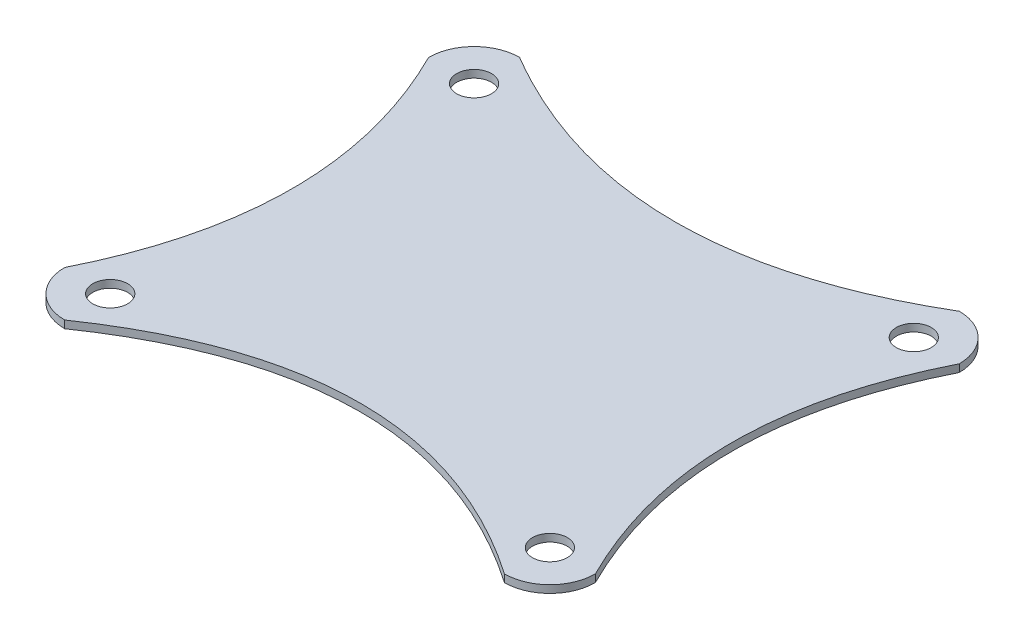
ISO-10303-21;
HEADER;
FILE_DESCRIPTION(('STEP AP214'),'2;1');
FILE_NAME('part.step','',(''),(''),'','','');
FILE_SCHEMA(('AUTOMOTIVE_DESIGN { 1 0 10303 214 1 1 1 1 }'));
ENDSEC;
DATA;
#1=APPLICATION_CONTEXT('core data for automotive mechanical design processes');
#2=APPLICATION_PROTOCOL_DEFINITION('international standard','automotive_design',2000,#1);
#3=PRODUCT_CONTEXT('',#1,'mechanical');
#4=PRODUCT('Part','Part','',(#3));
#5=PRODUCT_RELATED_PRODUCT_CATEGORY('part','',(#4));
#6=PRODUCT_DEFINITION_FORMATION('','',#4);
#7=PRODUCT_DEFINITION_CONTEXT('part definition',#1,'design');
#8=PRODUCT_DEFINITION('design','',#6,#7);
#9=PRODUCT_DEFINITION_SHAPE('','',#8);
#10=(LENGTH_UNIT() NAMED_UNIT(*) SI_UNIT(.MILLI.,.METRE.));
#11=(NAMED_UNIT(*) PLANE_ANGLE_UNIT() SI_UNIT($,.RADIAN.));
#12=(NAMED_UNIT(*) SI_UNIT($,.STERADIAN.) SOLID_ANGLE_UNIT());
#13=UNCERTAINTY_MEASURE_WITH_UNIT(LENGTH_MEASURE(1.E-05),#10,'distance_accuracy_value','');
#14=(GEOMETRIC_REPRESENTATION_CONTEXT(3) GLOBAL_UNCERTAINTY_ASSIGNED_CONTEXT((#13)) GLOBAL_UNIT_ASSIGNED_CONTEXT((#10,
#11,#12)) REPRESENTATION_CONTEXT('',''));
#15=CARTESIAN_POINT('',(0.,0.,0.));
#16=DIRECTION('',(0.,0.,1.));
#17=DIRECTION('',(1.,0.,0.));
#18=AXIS2_PLACEMENT_3D('',#15,#16,#17);
#19=CARTESIAN_POINT('',(-59.7824977169571,-7.66920387963483,37.1259500647923));
#20=CARTESIAN_POINT('',(-45.2824977169571,-7.66920387962384,27.1259500647924));
#21=CARTESIAN_POINT('',(-30.7824977169571,-7.66920387961284,37.1259500647923));
#22=B_SPLINE_CURVE_WITH_KNOTS('',2,(#19,#20,#21),.UNSPECIFIED.,.F.,.F.,(3,3),(0.,1.),.UNSPECIFIED.);
#23=DIRECTION('',(7.58386409227541E-13,-1.,0.));
#24=VECTOR('',#23,1.);
#25=SURFACE_OF_LINEAR_EXTRUSION('',#22,#24);
#26=CARTESIAN_POINT('',(6439.3146370314,-8.16920387461947,1000032.12595006));
#27=CARTESIAN_POINT('',(-45.2824977156333,-8.16920387971058,-999967.874049935));
#28=CARTESIAN_POINT('',(-6529.87963246795,-8.16920388445474,1000032.12595006));
#29=B_SPLINE_CURVE_WITH_KNOTS('',2,(#26,#27,#28),.UNSPECIFIED.,.F.,.F.,(3,3),(0.,1.),.UNSPECIFIED.);
#30=CARTESIAN_POINT('',(-30.7824977169568,-8.16920387961284,37.1259500647923));
#31=VERTEX_POINT('',#30);
#32=CARTESIAN_POINT('',(-59.7824977169567,-8.16920387963484,37.1259500647923));
#33=VERTEX_POINT('',#32);
#34=EDGE_CURVE('E58',#31,#33,#29,.T.);
#35=ORIENTED_EDGE('',*,*,#34,.F.);
#36=DIRECTION('',(7.58386409227541E-13,-1.,0.));
#37=VECTOR('',#36,1.);
#38=CARTESIAN_POINT('',(-30.7824977169571,-7.66920387961284,37.1259500647923));
#39=LINE('',#38,#37);
#40=CARTESIAN_POINT('',(-30.7824977169571,-7.66920387961284,37.1259500647923));
#41=VERTEX_POINT('',#40);
#42=EDGE_CURVE('E127',#41,#31,#39,.T.);
#43=ORIENTED_EDGE('',*,*,#42,.F.);
#44=CARTESIAN_POINT('',(-59.7824977169571,-7.66920387963483,37.1259500647923));
#45=VERTEX_POINT('',#44);
#46=EDGE_CURVE('E231',#45,#41,#22,.T.);
#47=ORIENTED_EDGE('',*,*,#46,.F.);
#48=DIRECTION('',(7.58386409227541E-13,-1.,0.));
#49=VECTOR('',#48,1.);
#50=CARTESIAN_POINT('',(-59.7824977169571,-7.66920387963483,37.1259500647923));
#51=LINE('',#50,#49);
#52=EDGE_CURVE('E506',#45,#33,#51,.T.);
#53=ORIENTED_EDGE('',*,*,#52,.T.);
#54=EDGE_LOOP('',(#35,#43,#47,#53));
#55=FACE_BOUND('',#54,.T.);
#56=ADVANCED_FACE('F42',(#55),#25,.F.);
#57=CARTESIAN_POINT('',(-30.7824977169571,-7.66920387961284,34.1259500647923));
#58=DIRECTION('',(7.58386409227541E-13,-1.,0.));
#59=DIRECTION('',(1.,7.58386409227541E-13,0.));
#60=AXIS2_PLACEMENT_3D('',#57,#58,#59);
#61=CYLINDRICAL_SURFACE('',#60,3.00000000000001);
#62=CARTESIAN_POINT('',(-30.7824977169567,-8.16920387961284,34.1259500647923));
#63=DIRECTION('',(7.58356500202093E-13,-1.,0.));
#64=DIRECTION('',(1.,7.58356500202093E-13,0.));
#65=AXIS2_PLACEMENT_3D('',#62,#63,#64);
#66=CIRCLE('',#65,3.00000000000001);
#67=CARTESIAN_POINT('',(-27.7824977169567,-8.16920387961057,34.1259500647923));
#68=VERTEX_POINT('',#67);
#69=EDGE_CURVE('E110',#68,#31,#66,.T.);
#70=ORIENTED_EDGE('',*,*,#69,.F.);
#71=DIRECTION('',(7.58386409227541E-13,-1.,0.));
#72=VECTOR('',#71,1.);
#73=CARTESIAN_POINT('',(-27.7824977169571,-7.66920387961057,34.1259500647923));
#74=LINE('',#73,#72);
#75=CARTESIAN_POINT('',(-27.7824977169571,-7.66920387961057,34.1259500647923));
#76=VERTEX_POINT('',#75);
#77=EDGE_CURVE('E124',#76,#68,#74,.T.);
#78=ORIENTED_EDGE('',*,*,#77,.F.);
#79=CARTESIAN_POINT('',(-30.7824977169571,-7.66920387961284,34.1259500647923));
#80=DIRECTION('',(-7.58386409227541E-13,1.,0.));
#81=DIRECTION('',(-1.,-7.58386409227541E-13,0.));
#82=AXIS2_PLACEMENT_3D('',#79,#80,#81);
#83=CIRCLE('',#82,3.00000000000001);
#84=EDGE_CURVE('E238',#41,#76,#83,.T.);
#85=ORIENTED_EDGE('',*,*,#84,.F.);
#86=ORIENTED_EDGE('',*,*,#42,.T.);
#87=EDGE_LOOP('',(#70,#78,#85,#86));
#88=FACE_BOUND('',#87,.T.);
#89=ADVANCED_FACE('F123',(#88),#61,.T.);
#90=CARTESIAN_POINT('',(-27.7824977169571,-7.66920387961057,34.1259500647923));
#91=CARTESIAN_POINT('',(-33.7824977169571,-7.66920387961512,22.1259500647924));
#92=CARTESIAN_POINT('',(-27.7824977169571,-7.66920387961057,10.1259500647924));
#93=B_SPLINE_CURVE_WITH_KNOTS('',2,(#90,#91,#92),.UNSPECIFIED.,.F.,.F.,(3,3),(0.,1.),.UNSPECIFIED.);
#94=DIRECTION('',(7.58386409227541E-13,-1.,0.));
#95=VECTOR('',#94,1.);
#96=SURFACE_OF_LINEAR_EXTRUSION('',#93,#95);
#97=CARTESIAN_POINT('',(999969.217502283,-8.16920312125695,-6906.07728023078));
#98=CARTESIAN_POINT('',(-1000030.78249772,-8.16920463796935,22.1259500653703));
#99=CARTESIAN_POINT('',(999969.217502283,-8.16920312125574,6950.32918035921));
#100=B_SPLINE_CURVE_WITH_KNOTS('',2,(#97,#98,#99),.UNSPECIFIED.,.F.,.F.,(3,3),(0.,1.),.UNSPECIFIED.);
#101=CARTESIAN_POINT('',(-27.7824977353126,-8.16920387961057,10.1259500647924));
#102=VERTEX_POINT('',#101);
#103=EDGE_CURVE('E107',#102,#68,#100,.T.);
#104=ORIENTED_EDGE('',*,*,#103,.F.);
#105=DIRECTION('',(7.58386409227541E-13,-1.,0.));
#106=VECTOR('',#105,1.);
#107=CARTESIAN_POINT('',(-27.7824977169571,-7.66920387961057,10.1259500647924));
#108=LINE('',#107,#106);
#109=CARTESIAN_POINT('',(-27.7824977169571,-7.66920387961057,10.1259500647924));
#110=VERTEX_POINT('',#109);
#111=EDGE_CURVE('E133',#110,#102,#108,.T.);
#112=ORIENTED_EDGE('',*,*,#111,.F.);
#113=EDGE_CURVE('E131',#76,#110,#93,.T.);
#114=ORIENTED_EDGE('',*,*,#113,.F.);
#115=ORIENTED_EDGE('',*,*,#77,.T.);
#116=EDGE_LOOP('',(#104,#112,#114,#115));
#117=FACE_BOUND('',#116,.T.);
#118=ADVANCED_FACE('F130',(#117),#96,.F.);
#119=CARTESIAN_POINT('',(-30.7824977169571,-7.66920387961284,10.1259500647924));
#120=DIRECTION('',(7.58386409227541E-13,-1.,0.));
#121=DIRECTION('',(1.,7.58386409227541E-13,0.));
#122=AXIS2_PLACEMENT_3D('',#119,#120,#121);
#123=CYLINDRICAL_SURFACE('',#122,3.);
#124=CARTESIAN_POINT('',(-30.7824977169567,-8.16920387961285,10.1259500647924));
#125=DIRECTION('',(7.58356500202093E-13,-1.,0.));
#126=DIRECTION('',(1.,7.58356500202093E-13,0.));
#127=AXIS2_PLACEMENT_3D('',#124,#125,#126);
#128=CIRCLE('',#127,2.99999998164409);
#129=CARTESIAN_POINT('',(-30.7824977857175,-8.16920387961285,7.12595010526518));
#130=VERTEX_POINT('',#129);
#131=EDGE_CURVE('E112',#130,#102,#128,.T.);
#132=ORIENTED_EDGE('',*,*,#131,.F.);
#133=DIRECTION('',(7.58386409227541E-13,-1.,0.));
#134=VECTOR('',#133,1.);
#135=CARTESIAN_POINT('',(-30.7824977169571,-7.66920387961284,7.12595006479236));
#136=LINE('',#135,#134);
#137=CARTESIAN_POINT('',(-30.7824977169571,-7.66920387961284,7.12595006479236));
#138=VERTEX_POINT('',#137);
#139=EDGE_CURVE('E141',#138,#130,#136,.T.);
#140=ORIENTED_EDGE('',*,*,#139,.F.);
#141=CARTESIAN_POINT('',(-30.7824977169571,-7.66920387961284,10.1259500647924));
#142=DIRECTION('',(-7.58386409227541E-13,1.,0.));
#143=DIRECTION('',(-1.,-7.58386409227541E-13,0.));
#144=AXIS2_PLACEMENT_3D('',#141,#142,#143);
#145=CIRCLE('',#144,3.);
#146=EDGE_CURVE('E250',#110,#138,#145,.T.);
#147=ORIENTED_EDGE('',*,*,#146,.F.);
#148=ORIENTED_EDGE('',*,*,#111,.T.);
#149=EDGE_LOOP('',(#132,#140,#147,#148));
#150=FACE_BOUND('',#149,.T.);
#151=ADVANCED_FACE('F257',(#150),#123,.T.);
#152=CARTESIAN_POINT('',(-30.7824977169571,-7.66920387961284,7.12595006479236));
#153=CARTESIAN_POINT('',(-45.2824977169571,-7.66920387962384,15.6660698346732));
#154=CARTESIAN_POINT('',(-59.7824977169571,-7.66920387963483,7.12595006479236));
#155=B_SPLINE_CURVE_WITH_KNOTS('',2,(#152,#153,#154),.UNSPECIFIED.,.F.,.F.,(3,3),(0.,1.),.UNSPECIFIED.);
#156=DIRECTION('',(7.58386409227541E-13,-1.,0.));
#157=VECTOR('',#156,1.);
#158=SURFACE_OF_LINEAR_EXTRUSION('',#155,#157);
#159=CARTESIAN_POINT('',(-7062.27511089949,-8.16920388503196,-999988.60399005));
#160=CARTESIAN_POINT('',(-45.2824977169674,-8.16920387953711,1000011.39600995));
#161=CARTESIAN_POINT('',(6971.71011546555,-8.1692038743892,-999988.60399005));
#162=B_SPLINE_CURVE_WITH_KNOTS('',2,(#159,#160,#161),.UNSPECIFIED.,.F.,.F.,(3,3),(0.,1.),.UNSPECIFIED.);
#163=CARTESIAN_POINT('',(-59.7824977169567,-8.16920387963484,7.12595006343047));
#164=VERTEX_POINT('',#163);
#165=EDGE_CURVE('E493',#164,#130,#162,.T.);
#166=ORIENTED_EDGE('',*,*,#165,.F.);
#167=DIRECTION('',(7.58386409227541E-13,-1.,0.));
#168=VECTOR('',#167,1.);
#169=CARTESIAN_POINT('',(-59.7824977169571,-7.66920387963483,7.12595006479236));
#170=LINE('',#169,#168);
#171=CARTESIAN_POINT('',(-59.7824977169571,-7.66920387963483,7.12595006479236));
#172=VERTEX_POINT('',#171);
#173=EDGE_CURVE('E490',#172,#164,#170,.T.);
#174=ORIENTED_EDGE('',*,*,#173,.F.);
#175=EDGE_CURVE('E267',#138,#172,#155,.T.);
#176=ORIENTED_EDGE('',*,*,#175,.F.);
#177=ORIENTED_EDGE('',*,*,#139,.T.);
#178=EDGE_LOOP('',(#166,#174,#176,#177));
#179=FACE_BOUND('',#178,.T.);
#180=ADVANCED_FACE('F260',(#179),#158,.F.);
#181=CARTESIAN_POINT('',(-59.7824977169571,-7.66920387963483,10.1259500647924));
#182=DIRECTION('',(7.58386409227541E-13,-1.,0.));
#183=DIRECTION('',(1.,7.58386409227541E-13,0.));
#184=AXIS2_PLACEMENT_3D('',#181,#182,#183);
#185=CYLINDRICAL_SURFACE('',#184,3.);
#186=CARTESIAN_POINT('',(-59.7824977169567,-8.16920387963484,10.1259500647924));
#187=DIRECTION('',(7.58356500202093E-13,-1.,0.));
#188=DIRECTION('',(1.,7.58356500202093E-13,0.));
#189=AXIS2_PLACEMENT_3D('',#186,#187,#188);
#190=CIRCLE('',#189,3.00000000136189);
#191=CARTESIAN_POINT('',(-62.7824977203101,-8.16920387963712,10.1259500578981));
#192=VERTEX_POINT('',#191);
#193=EDGE_CURVE('E484',#192,#164,#190,.T.);
#194=ORIENTED_EDGE('',*,*,#193,.F.);
#195=DIRECTION('',(7.58386409227541E-13,-1.,0.));
#196=VECTOR('',#195,1.);
#197=CARTESIAN_POINT('',(-62.7824977169571,-7.66920387963711,10.1259500647924));
#198=LINE('',#197,#196);
#199=CARTESIAN_POINT('',(-62.7824977169571,-7.66920387963711,10.1259500647924));
#200=VERTEX_POINT('',#199);
#201=EDGE_CURVE('E487',#200,#192,#198,.T.);
#202=ORIENTED_EDGE('',*,*,#201,.F.);
#203=CARTESIAN_POINT('',(-59.7824977169571,-7.66920387963483,10.1259500647924));
#204=DIRECTION('',(-7.58386409227541E-13,1.,0.));
#205=DIRECTION('',(-1.,-7.58386409227541E-13,0.));
#206=AXIS2_PLACEMENT_3D('',#203,#204,#205);
#207=CIRCLE('',#206,3.);
#208=EDGE_CURVE('E273',#172,#200,#207,.T.);
#209=ORIENTED_EDGE('',*,*,#208,.F.);
#210=ORIENTED_EDGE('',*,*,#173,.T.);
#211=EDGE_LOOP('',(#194,#202,#209,#210));
#212=FACE_BOUND('',#211,.T.);
#213=ADVANCED_FACE('F264',(#212),#185,.T.);
#214=CARTESIAN_POINT('',(-62.7824977169571,-7.66920387963711,10.1259500647924));
#215=CARTESIAN_POINT('',(-56.7824977169571,-7.66920387963256,22.1259500647924));
#216=CARTESIAN_POINT('',(-62.7824977169571,-7.66920387963711,34.1259500647923));
#217=B_SPLINE_CURVE_WITH_KNOTS('',2,(#214,#215,#216),.UNSPECIFIED.,.F.,.F.,(3,3),(0.,1.),.UNSPECIFIED.);
#218=DIRECTION('',(7.58386409227541E-13,-1.,0.));
#219=VECTOR('',#218,1.);
#220=SURFACE_OF_LINEAR_EXTRUSION('',#217,#219);
#221=CARTESIAN_POINT('',(-1000059.78249772,-8.16920463799074,6950.3291803299));
#222=CARTESIAN_POINT('',(999940.217502283,-8.16920312127834,22.1259500649937));
#223=CARTESIAN_POINT('',(-1000059.78249772,-8.16920463799194,-6906.07728020107));
#224=B_SPLINE_CURVE_WITH_KNOTS('',2,(#221,#222,#223),.UNSPECIFIED.,.F.,.F.,(3,3),(0.,1.),.UNSPECIFIED.);
#225=CARTESIAN_POINT('',(-62.782497700169,-8.16920387963711,34.1259500647923));
#226=VERTEX_POINT('',#225);
#227=EDGE_CURVE('E494',#226,#192,#224,.T.);
#228=ORIENTED_EDGE('',*,*,#227,.F.);
#229=DIRECTION('',(7.58386409227541E-13,-1.,0.));
#230=VECTOR('',#229,1.);
#231=CARTESIAN_POINT('',(-62.7824977169571,-7.66920387963711,34.1259500647923));
#232=LINE('',#231,#230);
#233=CARTESIAN_POINT('',(-62.7824977169571,-7.66920387963711,34.1259500647923));
#234=VERTEX_POINT('',#233);
#235=EDGE_CURVE('E500',#234,#226,#232,.T.);
#236=ORIENTED_EDGE('',*,*,#235,.F.);
#237=EDGE_CURVE('E279',#200,#234,#217,.T.);
#238=ORIENTED_EDGE('',*,*,#237,.F.);
#239=ORIENTED_EDGE('',*,*,#201,.T.);
#240=EDGE_LOOP('',(#228,#236,#238,#239));
#241=FACE_BOUND('',#240,.T.);
#242=ADVANCED_FACE('F289',(#241),#220,.F.);
#243=CARTESIAN_POINT('',(-59.7824977169571,-7.66920387963483,34.1259500647923));
#244=DIRECTION('',(7.58386409227541E-13,-1.,0.));
#245=DIRECTION('',(1.,7.58386409227541E-13,0.));
#246=AXIS2_PLACEMENT_3D('',#243,#244,#245);
#247=CYLINDRICAL_SURFACE('',#246,3.);
#248=CARTESIAN_POINT('',(-59.7824977169567,-8.16920387963484,34.1259500647923));
#249=DIRECTION('',(7.58356500202093E-13,-1.,0.));
#250=DIRECTION('',(1.,7.58356500202093E-13,0.));
#251=AXIS2_PLACEMENT_3D('',#248,#249,#250);
#252=CIRCLE('',#251,2.99999998321226);
#253=EDGE_CURVE('E561',#33,#226,#252,.T.);
#254=ORIENTED_EDGE('',*,*,#253,.F.);
#255=ORIENTED_EDGE('',*,*,#52,.F.);
#256=CARTESIAN_POINT('',(-59.7824977169571,-7.66920387963483,34.1259500647923));
#257=DIRECTION('',(-7.58386409227541E-13,1.,0.));
#258=DIRECTION('',(1.,7.58386409227541E-13,0.));
#259=AXIS2_PLACEMENT_3D('',#256,#257,#258);
#260=CIRCLE('',#259,3.);
#261=EDGE_CURVE('E66',#234,#45,#260,.T.);
#262=ORIENTED_EDGE('',*,*,#261,.F.);
#263=ORIENTED_EDGE('',*,*,#235,.T.);
#264=EDGE_LOOP('',(#254,#255,#262,#263));
#265=FACE_BOUND('',#264,.T.);
#266=ADVANCED_FACE('F292',(#265),#247,.T.);
#267=CARTESIAN_POINT('',(-30.7824977169571,-7.66920387961284,34.1259500647923));
#268=DIRECTION('',(7.58386409227541E-13,-1.,0.));
#269=DIRECTION('',(1.,7.58386409227541E-13,0.));
#270=AXIS2_PLACEMENT_3D('',#267,#268,#269);
#271=CYLINDRICAL_SURFACE('',#270,1.15);
#272=CARTESIAN_POINT('',(-30.7824977169571,-7.66920387961284,34.1259500647923));
#273=DIRECTION('',(-7.58386409227541E-13,1.,0.));
#274=DIRECTION('',(-1.,-7.58386409227541E-13,0.));
#275=AXIS2_PLACEMENT_3D('',#272,#273,#274);
#276=CIRCLE('',#275,1.15);
#277=CARTESIAN_POINT('',(-31.9324977169571,-7.66920387961372,34.1259500647923));
#278=VERTEX_POINT('',#277);
#279=EDGE_CURVE('E239',#278,#278,#276,.T.);
#280=ORIENTED_EDGE('',*,*,#279,.T.);
#281=EDGE_LOOP('',(#280));
#282=FACE_BOUND('',#281,.T.);
#283=CARTESIAN_POINT('',(-30.7824977169567,-8.16920387961284,34.1259500647923));
#284=DIRECTION('',(7.58356499559049E-13,-1.,0.));
#285=DIRECTION('',(1.,7.58356499559049E-13,0.));
#286=AXIS2_PLACEMENT_3D('',#283,#284,#285);
#287=CIRCLE('',#286,1.15);
#288=CARTESIAN_POINT('',(-29.6324977169567,-8.16920387961197,34.1259500647923));
#289=VERTEX_POINT('',#288);
#290=EDGE_CURVE('E526',#289,#289,#287,.T.);
#291=ORIENTED_EDGE('',*,*,#290,.T.);
#292=EDGE_LOOP('',(#291));
#293=FACE_BOUND('',#292,.T.);
#294=ADVANCED_FACE('F296',(#282,#293),#271,.F.);
#295=CARTESIAN_POINT('',(-59.7824977169571,-7.66920387963483,34.1259500647923));
#296=DIRECTION('',(7.58386409227541E-13,-1.,0.));
#297=DIRECTION('',(1.,7.58386409227541E-13,0.));
#298=AXIS2_PLACEMENT_3D('',#295,#296,#297);
#299=CYLINDRICAL_SURFACE('',#298,1.15);
#300=CARTESIAN_POINT('',(-59.7824977169571,-7.66920387963483,34.1259500647923));
#301=DIRECTION('',(-7.58386409227541E-13,1.,0.));
#302=DIRECTION('',(-1.,-7.58386409227541E-13,0.));
#303=AXIS2_PLACEMENT_3D('',#300,#301,#302);
#304=CIRCLE('',#303,1.15);
#305=CARTESIAN_POINT('',(-60.9324977169571,-7.66920387963571,34.1259500647923));
#306=VERTEX_POINT('',#305);
#307=EDGE_CURVE('E537',#306,#306,#304,.T.);
#308=ORIENTED_EDGE('',*,*,#307,.T.);
#309=EDGE_LOOP('',(#308));
#310=FACE_BOUND('',#309,.T.);
#311=CARTESIAN_POINT('',(-59.7824977169567,-8.16920387963484,34.1259500647923));
#312=DIRECTION('',(7.58356499559049E-13,-1.,0.));
#313=DIRECTION('',(1.,7.58356499559049E-13,0.));
#314=AXIS2_PLACEMENT_3D('',#311,#312,#313);
#315=CIRCLE('',#314,1.15);
#316=CARTESIAN_POINT('',(-58.6324977169567,-8.16920387963397,34.1259500647923));
#317=VERTEX_POINT('',#316);
#318=EDGE_CURVE('E522',#317,#317,#315,.T.);
#319=ORIENTED_EDGE('',*,*,#318,.T.);
#320=EDGE_LOOP('',(#319));
#321=FACE_BOUND('',#320,.T.);
#322=ADVANCED_FACE('F304',(#310,#321),#299,.F.);
#323=CARTESIAN_POINT('',(-59.7824977169571,-7.66920387963483,10.1259500647924));
#324=DIRECTION('',(7.58386409227541E-13,-1.,0.));
#325=DIRECTION('',(1.,7.58386409227541E-13,0.));
#326=AXIS2_PLACEMENT_3D('',#323,#324,#325);
#327=CYLINDRICAL_SURFACE('',#326,1.15);
#328=CARTESIAN_POINT('',(-59.7824977169571,-7.66920387963483,10.1259500647924));
#329=DIRECTION('',(-7.58386409227541E-13,1.,0.));
#330=DIRECTION('',(-1.,-7.58386409227541E-13,0.));
#331=AXIS2_PLACEMENT_3D('',#328,#329,#330);
#332=CIRCLE('',#331,1.15);
#333=CARTESIAN_POINT('',(-60.9324977169571,-7.66920387963571,10.1259500647924));
#334=VERTEX_POINT('',#333);
#335=EDGE_CURVE('E534',#334,#334,#332,.T.);
#336=ORIENTED_EDGE('',*,*,#335,.T.);
#337=EDGE_LOOP('',(#336));
#338=FACE_BOUND('',#337,.T.);
#339=CARTESIAN_POINT('',(-59.7824977169567,-8.16920387963484,10.1259500647924));
#340=DIRECTION('',(7.58356499559049E-13,-1.,0.));
#341=DIRECTION('',(1.,7.58356499559049E-13,0.));
#342=AXIS2_PLACEMENT_3D('',#339,#340,#341);
#343=CIRCLE('',#342,1.15);
#344=CARTESIAN_POINT('',(-58.6324977169567,-8.16920387963397,10.1259500647924));
#345=VERTEX_POINT('',#344);
#346=EDGE_CURVE('E149',#345,#345,#343,.T.);
#347=ORIENTED_EDGE('',*,*,#346,.T.);
#348=EDGE_LOOP('',(#347));
#349=FACE_BOUND('',#348,.T.);
#350=ADVANCED_FACE('F308',(#338,#349),#327,.F.);
#351=CARTESIAN_POINT('',(-30.7824977169571,-7.66920387961284,10.1259500647924));
#352=DIRECTION('',(7.58386409227541E-13,-1.,0.));
#353=DIRECTION('',(1.,7.58386409227541E-13,0.));
#354=AXIS2_PLACEMENT_3D('',#351,#352,#353);
#355=CYLINDRICAL_SURFACE('',#354,1.15);
#356=CARTESIAN_POINT('',(-30.7824977169571,-7.66920387961284,10.1259500647924));
#357=DIRECTION('',(-7.58386409227541E-13,1.,0.));
#358=DIRECTION('',(-1.,-7.58386409227541E-13,0.));
#359=AXIS2_PLACEMENT_3D('',#356,#357,#358);
#360=CIRCLE('',#359,1.15);
#361=CARTESIAN_POINT('',(-31.9324977169571,-7.66920387961372,10.1259500647924));
#362=VERTEX_POINT('',#361);
#363=EDGE_CURVE('E530',#362,#362,#360,.T.);
#364=ORIENTED_EDGE('',*,*,#363,.T.);
#365=EDGE_LOOP('',(#364));
#366=FACE_BOUND('',#365,.T.);
#367=CARTESIAN_POINT('',(-30.7824977169567,-8.16920387961285,10.1259500647924));
#368=DIRECTION('',(7.58356499559049E-13,-1.,0.));
#369=DIRECTION('',(1.,7.58356499559049E-13,0.));
#370=AXIS2_PLACEMENT_3D('',#367,#368,#369);
#371=CIRCLE('',#370,1.15);
#372=CARTESIAN_POINT('',(-29.6324977169567,-8.16920387961198,10.1259500647924));
#373=VERTEX_POINT('',#372);
#374=EDGE_CURVE('E145',#373,#373,#371,.T.);
#375=ORIENTED_EDGE('',*,*,#374,.T.);
#376=EDGE_LOOP('',(#375));
#377=FACE_BOUND('',#376,.T.);
#378=ADVANCED_FACE('F301',(#366,#377),#355,.F.);
#379=CARTESIAN_POINT('',(-45.2824977169571,-7.66920387962384,32.1259500647924));
#380=DIRECTION('',(7.58356500202093E-13,-1.,0.));
#381=DIRECTION('',(1.,7.58356500202093E-13,0.));
#382=AXIS2_PLACEMENT_3D('',#379,#380,#381);
#383=PLANE('',#382);
#384=ORIENTED_EDGE('',*,*,#46,.T.);
#385=ORIENTED_EDGE('',*,*,#84,.T.);
#386=ORIENTED_EDGE('',*,*,#113,.T.);
#387=ORIENTED_EDGE('',*,*,#146,.T.);
#388=ORIENTED_EDGE('',*,*,#175,.T.);
#389=ORIENTED_EDGE('',*,*,#208,.T.);
#390=ORIENTED_EDGE('',*,*,#237,.T.);
#391=ORIENTED_EDGE('',*,*,#261,.T.);
#392=EDGE_LOOP('',(#384,#385,#386,#387,#388,#389,#390,#391));
#393=FACE_BOUND('',#392,.T.);
#394=ORIENTED_EDGE('',*,*,#279,.F.);
#395=EDGE_LOOP('',(#394));
#396=FACE_BOUND('',#395,.T.);
#397=ORIENTED_EDGE('',*,*,#307,.F.);
#398=EDGE_LOOP('',(#397));
#399=FACE_BOUND('',#398,.T.);
#400=ORIENTED_EDGE('',*,*,#335,.F.);
#401=EDGE_LOOP('',(#400));
#402=FACE_BOUND('',#401,.T.);
#403=ORIENTED_EDGE('',*,*,#363,.F.);
#404=EDGE_LOOP('',(#403));
#405=FACE_BOUND('',#404,.T.);
#406=ADVANCED_FACE('F298',(#393,#396,#399,#402,#405),#383,.F.);
#407=CARTESIAN_POINT('',(-30.7824977169017,-8.16920387961285,22.1259500647921));
#408=DIRECTION('',(7.58356499559049E-13,-1.,0.));
#409=DIRECTION('',(1.,7.58356499559049E-13,0.));
#410=AXIS2_PLACEMENT_3D('',#407,#408,#409);
#411=PLANE('',#410);
#412=CARTESIAN_POINT('',(-45.2824977169567,-8.16920387962384,22.1259500647924));
#413=DIRECTION('',(7.58356499559049E-13,-1.,0.));
#414=DIRECTION('',(1.,7.58356499559049E-13,0.));
#415=AXIS2_PLACEMENT_3D('',#412,#413,#414);
#416=CIRCLE('',#415,6.26266233674211);
#417=CARTESIAN_POINT('',(-39.0198353802146,-8.1692038796191,22.1259500647924));
#418=VERTEX_POINT('',#417);
#419=EDGE_CURVE('E51',#418,#418,#416,.F.);
#420=ORIENTED_EDGE('',*,*,#419,.T.);
#421=EDGE_LOOP('',(#420));
#422=FACE_BOUND('',#421,.T.);
#423=ORIENTED_EDGE('',*,*,#290,.F.);
#424=EDGE_LOOP('',(#423));
#425=FACE_BOUND('',#424,.T.);
#426=ORIENTED_EDGE('',*,*,#318,.F.);
#427=EDGE_LOOP('',(#426));
#428=FACE_BOUND('',#427,.T.);
#429=ORIENTED_EDGE('',*,*,#346,.F.);
#430=EDGE_LOOP('',(#429));
#431=FACE_BOUND('',#430,.T.);
#432=ORIENTED_EDGE('',*,*,#374,.F.);
#433=EDGE_LOOP('',(#432));
#434=FACE_BOUND('',#433,.T.);
#435=ORIENTED_EDGE('',*,*,#103,.T.);
#436=ORIENTED_EDGE('',*,*,#69,.T.);
#437=ORIENTED_EDGE('',*,*,#34,.T.);
#438=ORIENTED_EDGE('',*,*,#253,.T.);
#439=ORIENTED_EDGE('',*,*,#227,.T.);
#440=ORIENTED_EDGE('',*,*,#193,.T.);
#441=ORIENTED_EDGE('',*,*,#165,.T.);
#442=ORIENTED_EDGE('',*,*,#131,.T.);
#443=EDGE_LOOP('',(#435,#436,#437,#438,#439,#440,#441,#442));
#444=FACE_BOUND('',#443,.T.);
#445=ADVANCED_FACE('F109',(#422,#425,#428,#431,#434,#444),#411,.T.);
#446=CARTESIAN_POINT('',(-45.282497716956,-9.16920387962384,22.1259500647924));
#447=DIRECTION('',(-7.58356499559049E-13,1.,0.));
#448=DIRECTION('',(-1.,-7.58356499559049E-13,0.));
#449=AXIS2_PLACEMENT_3D('',#446,#447,#448);
#450=CYLINDRICAL_SURFACE('',#449,5.76266233674211);
#451=CARTESIAN_POINT('',(-45.2824977169563,-8.66920387962385,22.1259500647924));
#452=DIRECTION('',(7.58356499559049E-13,-1.,0.));
#453=DIRECTION('',(1.,7.58356499559049E-13,0.));
#454=AXIS2_PLACEMENT_3D('',#451,#452,#453);
#455=CIRCLE('',#454,5.76266233674211);
#456=CARTESIAN_POINT('',(-39.5198353802142,-8.66920387961948,22.1259500647924));
#457=VERTEX_POINT('',#456);
#458=EDGE_CURVE('E169',#457,#457,#455,.T.);
#459=ORIENTED_EDGE('',*,*,#458,.T.);
#460=EDGE_LOOP('',(#459));
#461=FACE_BOUND('',#460,.T.);
#462=CARTESIAN_POINT('',(-45.2824977169561,-8.99448637653014,22.1259500647924));
#463=DIRECTION('',(-7.58805135262289E-13,1.,0.));
#464=DIRECTION('',(-1.,-7.58805135262289E-13,0.));
#465=AXIS2_PLACEMENT_3D('',#462,#463,#464);
#466=CIRCLE('',#465,5.76266233674211);
#467=CARTESIAN_POINT('',(-51.0451600536982,-8.99448637653451,22.1259500647924));
#468=VERTEX_POINT('',#467);
#469=EDGE_CURVE('E165',#468,#468,#466,.T.);
#470=ORIENTED_EDGE('',*,*,#469,.T.);
#471=EDGE_LOOP('',(#470));
#472=FACE_BOUND('',#471,.T.);
#473=ADVANCED_FACE('F187',(#461,#472),#450,.T.);
#474=CARTESIAN_POINT('',(-45.2824977133441,-9.16920387962385,22.1259500632254));
#475=DIRECTION('',(-7.59253770965529E-13,1.,0.));
#476=DIRECTION('',(0.,0.,-1.));
#477=AXIS2_PLACEMENT_3D('',#474,#475,#476);
#478=TOROIDAL_SURFACE('',#477,5.04957059831694,0.500000000000006);
#479=CARTESIAN_POINT('',(-45.2824977133443,-8.93397724672115,22.1259500632254));
#480=DIRECTION('',(7.59253770965529E-13,-1.,0.));
#481=DIRECTION('',(0.,0.,1.));
#482=AXIS2_PLACEMENT_3D('',#479,#480,#481);
#483=CIRCLE('',#482,5.49078305413983);
#484=CARTESIAN_POINT('',(-45.2824977133443,-8.93397724672115,27.6167331173652));
#485=VERTEX_POINT('',#484);
#486=EDGE_CURVE('E153',#485,#485,#483,.T.);
#487=ORIENTED_EDGE('',*,*,#486,.T.);
#488=EDGE_LOOP('',(#487));
#489=FACE_BOUND('',#488,.T.);
#490=CARTESIAN_POINT('',(-45.2824977133443,-8.91920387962384,22.1259500632254));
#491=DIRECTION('',(7.58356499559049E-13,-1.,0.));
#492=DIRECTION('',(1.,7.58356499559049E-13,0.));
#493=AXIS2_PLACEMENT_3D('',#490,#491,#492);
#494=CIRCLE('',#493,4.6165578964247);
#495=CARTESIAN_POINT('',(-40.6659398169196,-8.91920387962034,22.1259500632254));
#496=VERTEX_POINT('',#495);
#497=EDGE_CURVE('E138',#496,#496,#494,.F.);
#498=ORIENTED_EDGE('',*,*,#497,.T.);
#499=EDGE_LOOP('',(#498));
#500=FACE_BOUND('',#499,.T.);
#501=ADVANCED_FACE('F190',(#489,#500),#478,.F.);
#502=CARTESIAN_POINT('',(-45.282497716956,-9.16920387962384,22.1259500647924));
#503=DIRECTION('',(7.58356499559049E-13,-1.,0.));
#504=DIRECTION('',(1.,7.58356499559049E-13,0.));
#505=AXIS2_PLACEMENT_3D('',#502,#503,#504);
#506=PLANE('',#505);
#507=CARTESIAN_POINT('',(-45.2824977133441,-9.16920387962384,22.1259500632254));
#508=DIRECTION('',(7.58356499559049E-13,-1.,0.));
#509=DIRECTION('',(1.,7.58356499559049E-13,0.));
#510=AXIS2_PLACEMENT_3D('',#507,#508,#509);
#511=CIRCLE('',#510,4.05323526566014);
#512=CARTESIAN_POINT('',(-41.229262447684,-9.16920387962077,22.1259500632254));
#513=VERTEX_POINT('',#512);
#514=EDGE_CURVE('E11',#513,#513,#511,.F.);
#515=ORIENTED_EDGE('',*,*,#514,.T.);
#516=EDGE_LOOP('',(#515));
#517=FACE_BOUND('',#516,.T.);
#518=CARTESIAN_POINT('',(-45.2824977133441,-9.16920387962384,22.1259500632254));
#519=DIRECTION('',(7.58356499559049E-13,-1.,0.));
#520=DIRECTION('',(1.,7.58356499559049E-13,0.));
#521=AXIS2_PLACEMENT_3D('',#518,#519,#520);
#522=CIRCLE('',#521,4.1835451945325);
#523=CARTESIAN_POINT('',(-41.0989525188116,-9.16920387962067,22.1259500632254));
#524=VERTEX_POINT('',#523);
#525=EDGE_CURVE('E157',#524,#524,#522,.T.);
#526=ORIENTED_EDGE('',*,*,#525,.T.);
#527=EDGE_LOOP('',(#526));
#528=FACE_BOUND('',#527,.T.);
#529=ADVANCED_FACE('F203',(#517,#528),#506,.T.);
#530=CARTESIAN_POINT('',(-45.2824977169563,-8.69875061231904,22.1259500647924));
#531=DIRECTION('',(-7.59253770965529E-13,1.,0.));
#532=DIRECTION('',(0.,0.,-1.));
#533=AXIS2_PLACEMENT_3D('',#530,#531,#532);
#534=TOROIDAL_SURFACE('',#533,5.93199550916332,0.5);
#535=CARTESIAN_POINT('',(-45.282497716956,-9.06842031758289,22.1259500647924));
#536=DIRECTION('',(-7.58805135262289E-13,1.,0.));
#537=DIRECTION('',(-1.,-7.58805135262289E-13,0.));
#538=AXIS2_PLACEMENT_3D('',#535,#536,#537);
#539=CIRCLE('',#538,5.59532904363682);
#540=CARTESIAN_POINT('',(-50.8778267605929,-9.06842031758714,22.1259500647924));
#541=VERTEX_POINT('',#540);
#542=EDGE_CURVE('E161',#541,#541,#539,.F.);
#543=ORIENTED_EDGE('',*,*,#542,.T.);
#544=EDGE_LOOP('',(#543));
#545=FACE_BOUND('',#544,.T.);
#546=ORIENTED_EDGE('',*,*,#486,.F.);
#547=EDGE_LOOP('',(#546));
#548=FACE_BOUND('',#547,.T.);
#549=ADVANCED_FACE('F200',(#545,#548),#534,.T.);
#550=CARTESIAN_POINT('',(-45.2824977133445,-8.66920387962384,22.1259500632254));
#551=DIRECTION('',(-7.58356499559049E-13,1.,0.));
#552=DIRECTION('',(-1.,-7.58356499559049E-13,0.));
#553=AXIS2_PLACEMENT_3D('',#550,#551,#552);
#554=TOROIDAL_SURFACE('',#553,4.1835451945325,0.5);
#555=ORIENTED_EDGE('',*,*,#497,.F.);
#556=EDGE_LOOP('',(#555));
#557=FACE_BOUND('',#556,.T.);
#558=ORIENTED_EDGE('',*,*,#525,.F.);
#559=EDGE_LOOP('',(#558));
#560=FACE_BOUND('',#559,.T.);
#561=ADVANCED_FACE('F196',(#557,#560),#554,.T.);
#562=CARTESIAN_POINT('',(-45.2824977169561,-8.99448637653014,22.1259500647924));
#563=DIRECTION('',(-7.58805135262289E-13,1.,0.));
#564=DIRECTION('',(-1.,-7.58805135262289E-13,0.));
#565=AXIS2_PLACEMENT_3D('',#562,#563,#564);
#566=TOROIDAL_SURFACE('',#565,5.66266233674211,0.1);
#567=ORIENTED_EDGE('',*,*,#469,.F.);
#568=EDGE_LOOP('',(#567));
#569=FACE_BOUND('',#568,.T.);
#570=ORIENTED_EDGE('',*,*,#542,.F.);
#571=EDGE_LOOP('',(#570));
#572=FACE_BOUND('',#571,.T.);
#573=ADVANCED_FACE('F184',(#569,#572),#566,.T.);
#574=CARTESIAN_POINT('',(-45.2824977169563,-8.66920387962385,22.1259500647924));
#575=DIRECTION('',(7.58356499559049E-13,-1.,0.));
#576=DIRECTION('',(1.,7.58356499559049E-13,0.));
#577=AXIS2_PLACEMENT_3D('',#574,#575,#576);
#578=TOROIDAL_SURFACE('',#577,6.26266233674211,0.5);
#579=ORIENTED_EDGE('',*,*,#419,.F.);
#580=EDGE_LOOP('',(#579));
#581=FACE_BOUND('',#580,.T.);
#582=ORIENTED_EDGE('',*,*,#458,.F.);
#583=EDGE_LOOP('',(#582));
#584=FACE_BOUND('',#583,.T.);
#585=ADVANCED_FACE('F180',(#581,#584),#578,.F.);
#586=CARTESIAN_POINT('',(-45.2824977133445,-8.66920387962384,22.1259500632254));
#587=DIRECTION('',(7.58356499559049E-13,-1.,0.));
#588=DIRECTION('',(1.,7.58356499559049E-13,0.));
#589=AXIS2_PLACEMENT_3D('',#586,#587,#588);
#590=PLANE('',#589);
#591=CARTESIAN_POINT('',(-45.2824977133445,-8.66920387962384,22.1259500632254));
#592=DIRECTION('',(7.58356499559049E-13,-1.,0.));
#593=DIRECTION('',(1.,7.58356499559049E-13,0.));
#594=AXIS2_PLACEMENT_3D('',#591,#592,#593);
#595=CIRCLE('',#594,3.55323526566014);
#596=CARTESIAN_POINT('',(-41.7292624476844,-8.66920387962115,22.1259500632254));
#597=VERTEX_POINT('',#596);
#598=EDGE_CURVE('E118',#597,#597,#595,.T.);
#599=ORIENTED_EDGE('',*,*,#598,.T.);
#600=EDGE_LOOP('',(#599));
#601=FACE_BOUND('',#600,.T.);
#602=ADVANCED_FACE('F183',(#601),#590,.T.);
#603=CARTESIAN_POINT('',(-45.2824977133445,-8.66920387962384,22.1259500632254));
#604=DIRECTION('',(7.58356499559049E-13,-1.,0.));
#605=DIRECTION('',(1.,7.58356499559049E-13,0.));
#606=AXIS2_PLACEMENT_3D('',#603,#604,#605);
#607=TOROIDAL_SURFACE('',#606,4.05323526566014,0.5);
#608=ORIENTED_EDGE('',*,*,#514,.F.);
#609=EDGE_LOOP('',(#608));
#610=FACE_BOUND('',#609,.T.);
#611=ORIENTED_EDGE('',*,*,#598,.F.);
#612=EDGE_LOOP('',(#611));
#613=FACE_BOUND('',#612,.T.);
#614=ADVANCED_FACE('F44',(#610,#613),#607,.T.);
#615=CLOSED_SHELL('',(#56,#89,#118,#151,#180,#213,#242,#266,#294,#322,#350,#378,#406,#445,#473,
#501,#529,#549,#561,#573,#585,#602,#614));
#616=MANIFOLD_SOLID_BREP('B2',#615);
#617=ADVANCED_BREP_SHAPE_REPRESENTATION('',(#18,#616),#14);
#618=SHAPE_DEFINITION_REPRESENTATION(#9,#617);
ENDSEC;
END-ISO-10303-21;
